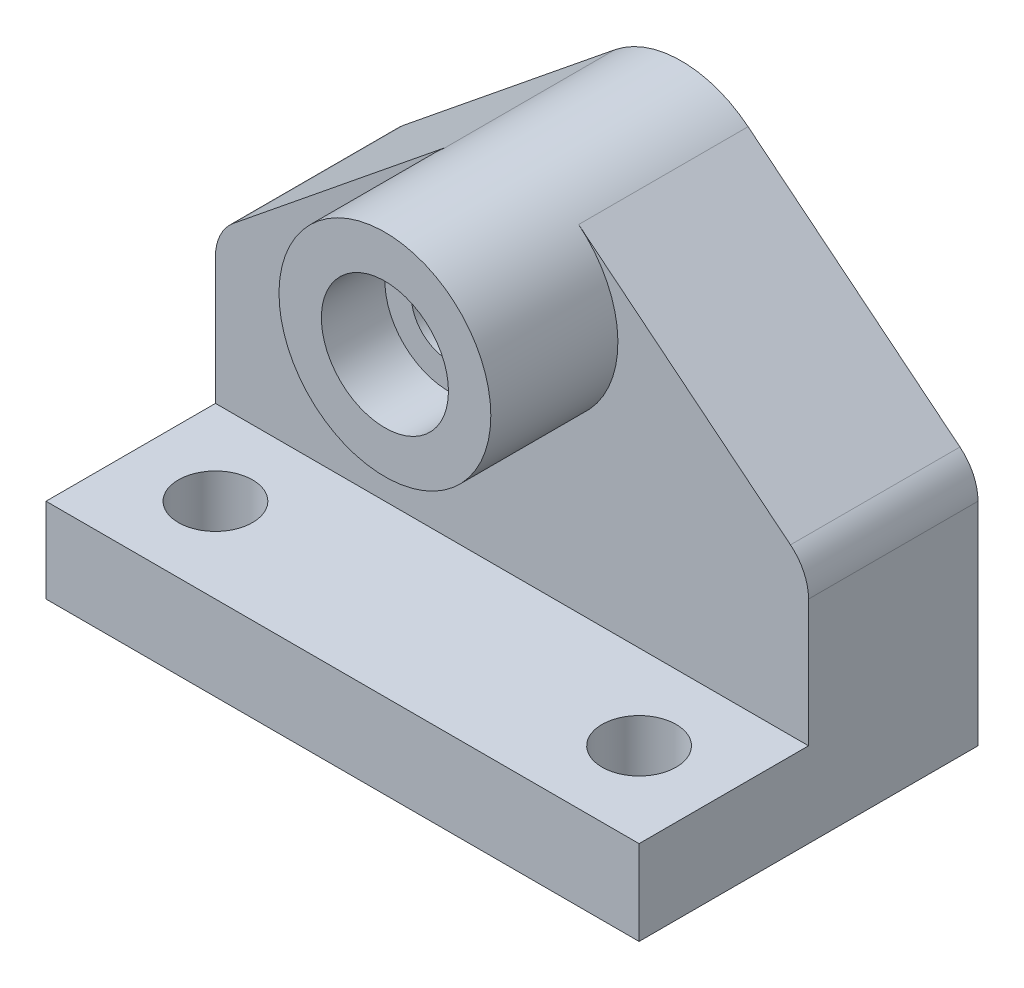
ISO-10303-21;
HEADER;
FILE_DESCRIPTION(('STEP AP214'),'2;1');
FILE_NAME('part.step','',(''),(''),'','','');
FILE_SCHEMA(('AUTOMOTIVE_DESIGN { 1 0 10303 214 1 1 1 1 }'));
ENDSEC;
DATA;
#1=APPLICATION_CONTEXT('core data for automotive mechanical design processes');
#2=APPLICATION_PROTOCOL_DEFINITION('international standard','automotive_design',2000,#1);
#3=PRODUCT_CONTEXT('',#1,'mechanical');
#4=PRODUCT('Part','Part','',(#3));
#5=PRODUCT_RELATED_PRODUCT_CATEGORY('part','',(#4));
#6=PRODUCT_DEFINITION_FORMATION('','',#4);
#7=PRODUCT_DEFINITION_CONTEXT('part definition',#1,'design');
#8=PRODUCT_DEFINITION('design','',#6,#7);
#9=PRODUCT_DEFINITION_SHAPE('','',#8);
#10=(LENGTH_UNIT() NAMED_UNIT(*) SI_UNIT(.MILLI.,.METRE.));
#11=(NAMED_UNIT(*) PLANE_ANGLE_UNIT() SI_UNIT($,.RADIAN.));
#12=(NAMED_UNIT(*) SI_UNIT($,.STERADIAN.) SOLID_ANGLE_UNIT());
#13=UNCERTAINTY_MEASURE_WITH_UNIT(LENGTH_MEASURE(1.E-05),#10,'distance_accuracy_value','');
#14=(GEOMETRIC_REPRESENTATION_CONTEXT(3) GLOBAL_UNCERTAINTY_ASSIGNED_CONTEXT((#13)) GLOBAL_UNIT_ASSIGNED_CONTEXT((#10,
#11,#12)) REPRESENTATION_CONTEXT('',''));
#15=CARTESIAN_POINT('',(0.,0.,0.));
#16=DIRECTION('',(0.,0.,1.));
#17=DIRECTION('',(1.,0.,0.));
#18=AXIS2_PLACEMENT_3D('',#15,#16,#17);
#19=CARTESIAN_POINT('',(70.,80.,40.));
#20=DIRECTION('',(0.,0.,-1.));
#21=DIRECTION('',(-1.,0.,0.));
#22=AXIS2_PLACEMENT_3D('',#19,#20,#21);
#23=PLANE('',#22);
#24=CARTESIAN_POINT('',(70.,80.,40.));
#25=DIRECTION('',(0.,0.,-1.));
#26=DIRECTION('',(-1.,0.,0.));
#27=AXIS2_PLACEMENT_3D('',#24,#25,#26);
#28=CIRCLE('',#27,25.);
#29=CARTESIAN_POINT('',(54.2688081868346,99.4301210530814,40.));
#30=VERTEX_POINT('',#29);
#31=CARTESIAN_POINT('',(85.7311918131654,99.4301210530814,40.));
#32=VERTEX_POINT('',#31);
#33=EDGE_CURVE('E11',#30,#32,#28,.F.);
#34=ORIENTED_EDGE('',*,*,#33,.F.);
#35=DIRECTION('',(0.777204842123257,0.629247672526616,0.));
#36=VECTOR('',#35,1.);
#37=CARTESIAN_POINT('',(-27.138854515152,33.5201067238951,40.));
#38=LINE('',#37,#36);
#39=CARTESIAN_POINT('',(4.26880818683461,58.9486650441633,40.));
#40=VERTEX_POINT('',#39);
#41=EDGE_CURVE('E100',#40,#30,#38,.T.);
#42=ORIENTED_EDGE('',*,*,#41,.F.);
#43=CARTESIAN_POINT('',(11.5139079933114,50.,40.));
#44=DIRECTION('',(0.,0.,1.));
#45=DIRECTION('',(1.,0.,0.));
#46=AXIS2_PLACEMENT_3D('',#43,#44,#45);
#47=CIRCLE('',#46,11.5139079933114);
#48=CARTESIAN_POINT('',(0.,50.,40.));
#49=VERTEX_POINT('',#48);
#50=EDGE_CURVE('E167',#49,#40,#47,.F.);
#51=ORIENTED_EDGE('',*,*,#50,.F.);
#52=DIRECTION('',(0.,-1.,0.));
#53=VECTOR('',#52,1.);
#54=CARTESIAN_POINT('',(0.,130.,40.));
#55=LINE('',#54,#53);
#56=CARTESIAN_POINT('',(0.,20.,40.));
#57=VERTEX_POINT('',#56);
#58=EDGE_CURVE('E158',#49,#57,#55,.T.);
#59=ORIENTED_EDGE('',*,*,#58,.T.);
#60=DIRECTION('',(-1.,0.,0.));
#61=VECTOR('',#60,1.);
#62=CARTESIAN_POINT('',(0.,20.,40.));
#63=LINE('',#62,#61);
#64=CARTESIAN_POINT('',(140.,20.,40.));
#65=VERTEX_POINT('',#64);
#66=EDGE_CURVE('E155',#65,#57,#63,.T.);
#67=ORIENTED_EDGE('',*,*,#66,.F.);
#68=DIRECTION('',(0.,-1.,0.));
#69=VECTOR('',#68,1.);
#70=CARTESIAN_POINT('',(140.,130.,40.));
#71=LINE('',#70,#69);
#72=CARTESIAN_POINT('',(140.,50.,40.));
#73=VERTEX_POINT('',#72);
#74=EDGE_CURVE('E161',#73,#65,#71,.T.);
#75=ORIENTED_EDGE('',*,*,#74,.F.);
#76=CARTESIAN_POINT('',(128.486092006689,50.,40.));
#77=DIRECTION('',(0.,0.,1.));
#78=DIRECTION('',(1.,0.,0.));
#79=AXIS2_PLACEMENT_3D('',#76,#77,#78);
#80=CIRCLE('',#79,11.5139079933114);
#81=CARTESIAN_POINT('',(135.731191813165,58.9486650441633,40.));
#82=VERTEX_POINT('',#81);
#83=EDGE_CURVE('E164',#73,#82,#80,.T.);
#84=ORIENTED_EDGE('',*,*,#83,.T.);
#85=DIRECTION('',(-0.777204842123257,0.629247672526616,0.));
#86=VECTOR('',#85,1.);
#87=CARTESIAN_POINT('',(82.5722231883748,101.987714041442,40.));
#88=LINE('',#87,#86);
#89=EDGE_CURVE('E182',#82,#32,#88,.T.);
#90=ORIENTED_EDGE('',*,*,#89,.T.);
#91=EDGE_LOOP('',(#34,#42,#51,#59,#67,#75,#84,#90));
#92=FACE_BOUND('',#91,.T.);
#93=ADVANCED_FACE('F37',(#92),#23,.F.);
#94=CARTESIAN_POINT('',(-27.138854515152,33.5201067238951,80.));
#95=DIRECTION('',(-0.629247672526616,0.777204842123257,0.));
#96=DIRECTION('',(-0.777204842123257,-0.629247672526616,0.));
#97=AXIS2_PLACEMENT_3D('',#94,#95,#96);
#98=PLANE('',#97);
#99=DIRECTION('',(0.,0.,-1.));
#100=VECTOR('',#99,1.);
#101=CARTESIAN_POINT('',(4.26880818683461,58.9486650441633,80.));
#102=LINE('',#101,#100);
#103=CARTESIAN_POINT('',(4.26880818683461,58.9486650441633,0.));
#104=VERTEX_POINT('',#103);
#105=EDGE_CURVE('E46',#40,#104,#102,.T.);
#106=ORIENTED_EDGE('',*,*,#105,.F.);
#107=ORIENTED_EDGE('',*,*,#41,.T.);
#108=DIRECTION('',(0.,0.,-1.));
#109=VECTOR('',#108,1.);
#110=CARTESIAN_POINT('',(54.2688081868346,99.4301210530814,40.));
#111=LINE('',#110,#109);
#112=CARTESIAN_POINT('',(54.2688081868346,99.4301210530814,0.));
#113=VERTEX_POINT('',#112);
#114=EDGE_CURVE('E108',#30,#113,#111,.T.);
#115=ORIENTED_EDGE('',*,*,#114,.T.);
#116=DIRECTION('',(0.777204842123257,0.629247672526616,0.));
#117=VECTOR('',#116,1.);
#118=CARTESIAN_POINT('',(-27.138854515152,33.5201067238951,0.));
#119=LINE('',#118,#117);
#120=EDGE_CURVE('E95',#104,#113,#119,.T.);
#121=ORIENTED_EDGE('',*,*,#120,.F.);
#122=EDGE_LOOP('',(#106,#107,#115,#121));
#123=FACE_BOUND('',#122,.T.);
#124=ADVANCED_FACE('F39',(#123),#98,.T.);
#125=CARTESIAN_POINT('',(11.5139079933114,50.,80.));
#126=DIRECTION('',(0.,0.,-1.));
#127=DIRECTION('',(-1.,0.,0.));
#128=AXIS2_PLACEMENT_3D('',#125,#126,#127);
#129=CYLINDRICAL_SURFACE('',#128,11.5139079933114);
#130=DIRECTION('',(0.,0.,-1.));
#131=VECTOR('',#130,1.);
#132=CARTESIAN_POINT('',(0.,50.,80.));
#133=LINE('',#132,#131);
#134=CARTESIAN_POINT('',(0.,50.,0.));
#135=VERTEX_POINT('',#134);
#136=EDGE_CURVE('E129',#49,#135,#133,.T.);
#137=ORIENTED_EDGE('',*,*,#136,.F.);
#138=ORIENTED_EDGE('',*,*,#50,.T.);
#139=ORIENTED_EDGE('',*,*,#105,.T.);
#140=CARTESIAN_POINT('',(11.5139079933114,50.,0.));
#141=DIRECTION('',(0.,0.,1.));
#142=DIRECTION('',(1.,0.,0.));
#143=AXIS2_PLACEMENT_3D('',#140,#141,#142);
#144=CIRCLE('',#143,11.5139079933114);
#145=EDGE_CURVE('E190',#135,#104,#144,.F.);
#146=ORIENTED_EDGE('',*,*,#145,.F.);
#147=EDGE_LOOP('',(#137,#138,#139,#146));
#148=FACE_BOUND('',#147,.T.);
#149=ADVANCED_FACE('F232',(#148),#129,.T.);
#150=CARTESIAN_POINT('',(0.,0.,80.));
#151=DIRECTION('',(-1.,0.,0.));
#152=DIRECTION('',(0.,0.,1.));
#153=AXIS2_PLACEMENT_3D('',#150,#151,#152);
#154=PLANE('',#153);
#155=DIRECTION('',(0.,0.,1.));
#156=VECTOR('',#155,1.);
#157=CARTESIAN_POINT('',(0.,20.,80.));
#158=LINE('',#157,#156);
#159=CARTESIAN_POINT('',(0.,20.,80.));
#160=VERTEX_POINT('',#159);
#161=EDGE_CURVE('E133',#57,#160,#158,.T.);
#162=ORIENTED_EDGE('',*,*,#161,.F.);
#163=ORIENTED_EDGE('',*,*,#58,.F.);
#164=ORIENTED_EDGE('',*,*,#136,.T.);
#165=DIRECTION('',(0.,1.,0.));
#166=VECTOR('',#165,1.);
#167=CARTESIAN_POINT('',(0.,0.,0.));
#168=LINE('',#167,#166);
#169=CARTESIAN_POINT('',(0.,0.,0.));
#170=VERTEX_POINT('',#169);
#171=EDGE_CURVE('E192',#170,#135,#168,.T.);
#172=ORIENTED_EDGE('',*,*,#171,.F.);
#173=DIRECTION('',(0.,0.,-1.));
#174=VECTOR('',#173,1.);
#175=CARTESIAN_POINT('',(0.,0.,80.));
#176=LINE('',#175,#174);
#177=CARTESIAN_POINT('',(0.,0.,80.));
#178=VERTEX_POINT('',#177);
#179=EDGE_CURVE('E127',#178,#170,#176,.T.);
#180=ORIENTED_EDGE('',*,*,#179,.F.);
#181=DIRECTION('',(0.,1.,0.));
#182=VECTOR('',#181,1.);
#183=CARTESIAN_POINT('',(0.,0.,80.));
#184=LINE('',#183,#182);
#185=EDGE_CURVE('E111',#178,#160,#184,.T.);
#186=ORIENTED_EDGE('',*,*,#185,.T.);
#187=EDGE_LOOP('',(#162,#163,#164,#172,#180,#186));
#188=FACE_BOUND('',#187,.T.);
#189=ADVANCED_FACE('F237',(#188),#154,.T.);
#190=CARTESIAN_POINT('',(140.,0.,80.));
#191=DIRECTION('',(-1.,0.,0.));
#192=DIRECTION('',(0.,0.,1.));
#193=AXIS2_PLACEMENT_3D('',#190,#191,#192);
#194=PLANE('',#193);
#195=ORIENTED_EDGE('',*,*,#74,.T.);
#196=DIRECTION('',(0.,0.,-1.));
#197=VECTOR('',#196,1.);
#198=CARTESIAN_POINT('',(140.,20.,80.));
#199=LINE('',#198,#197);
#200=CARTESIAN_POINT('',(140.,20.,80.));
#201=VERTEX_POINT('',#200);
#202=EDGE_CURVE('E152',#201,#65,#199,.T.);
#203=ORIENTED_EDGE('',*,*,#202,.F.);
#204=DIRECTION('',(0.,1.,0.));
#205=VECTOR('',#204,1.);
#206=CARTESIAN_POINT('',(140.,0.,80.));
#207=LINE('',#206,#205);
#208=CARTESIAN_POINT('',(140.,0.,80.));
#209=VERTEX_POINT('',#208);
#210=EDGE_CURVE('E122',#209,#201,#207,.T.);
#211=ORIENTED_EDGE('',*,*,#210,.F.);
#212=DIRECTION('',(0.,0.,-1.));
#213=VECTOR('',#212,1.);
#214=CARTESIAN_POINT('',(140.,0.,80.));
#215=LINE('',#214,#213);
#216=CARTESIAN_POINT('',(140.,0.,0.));
#217=VERTEX_POINT('',#216);
#218=EDGE_CURVE('E124',#209,#217,#215,.T.);
#219=ORIENTED_EDGE('',*,*,#218,.T.);
#220=DIRECTION('',(0.,1.,0.));
#221=VECTOR('',#220,1.);
#222=CARTESIAN_POINT('',(140.,0.,0.));
#223=LINE('',#222,#221);
#224=CARTESIAN_POINT('',(140.,50.,0.));
#225=VERTEX_POINT('',#224);
#226=EDGE_CURVE('E116',#217,#225,#223,.T.);
#227=ORIENTED_EDGE('',*,*,#226,.T.);
#228=DIRECTION('',(0.,0.,-1.));
#229=VECTOR('',#228,1.);
#230=CARTESIAN_POINT('',(140.,50.,80.));
#231=LINE('',#230,#229);
#232=EDGE_CURVE('E121',#73,#225,#231,.T.);
#233=ORIENTED_EDGE('',*,*,#232,.F.);
#234=EDGE_LOOP('',(#195,#203,#211,#219,#227,#233));
#235=FACE_BOUND('',#234,.T.);
#236=ADVANCED_FACE('F200',(#235),#194,.F.);
#237=CARTESIAN_POINT('',(128.486092006689,50.,80.));
#238=DIRECTION('',(0.,0.,-1.));
#239=DIRECTION('',(-1.,0.,0.));
#240=AXIS2_PLACEMENT_3D('',#237,#238,#239);
#241=CYLINDRICAL_SURFACE('',#240,11.5139079933114);
#242=ORIENTED_EDGE('',*,*,#83,.F.);
#243=ORIENTED_EDGE('',*,*,#232,.T.);
#244=CARTESIAN_POINT('',(128.486092006689,50.,0.));
#245=DIRECTION('',(0.,0.,1.));
#246=DIRECTION('',(1.,0.,0.));
#247=AXIS2_PLACEMENT_3D('',#244,#245,#246);
#248=CIRCLE('',#247,11.5139079933114);
#249=CARTESIAN_POINT('',(135.731191813165,58.9486650441633,0.));
#250=VERTEX_POINT('',#249);
#251=EDGE_CURVE('E112',#225,#250,#248,.T.);
#252=ORIENTED_EDGE('',*,*,#251,.T.);
#253=DIRECTION('',(0.,0.,-1.));
#254=VECTOR('',#253,1.);
#255=CARTESIAN_POINT('',(135.731191813165,58.9486650441633,80.));
#256=LINE('',#255,#254);
#257=EDGE_CURVE('E81',#82,#250,#256,.T.);
#258=ORIENTED_EDGE('',*,*,#257,.F.);
#259=EDGE_LOOP('',(#242,#243,#252,#258));
#260=FACE_BOUND('',#259,.T.);
#261=ADVANCED_FACE('F206',(#260),#241,.T.);
#262=CARTESIAN_POINT('',(82.5722231883748,101.987714041442,80.));
#263=DIRECTION('',(-0.629247672526616,-0.777204842123257,0.));
#264=DIRECTION('',(0.777204842123257,-0.629247672526616,0.));
#265=AXIS2_PLACEMENT_3D('',#262,#263,#264);
#266=PLANE('',#265);
#267=ORIENTED_EDGE('',*,*,#89,.F.);
#268=ORIENTED_EDGE('',*,*,#257,.T.);
#269=DIRECTION('',(-0.777204842123257,0.629247672526616,0.));
#270=VECTOR('',#269,1.);
#271=CARTESIAN_POINT('',(82.5722231883748,101.987714041442,0.));
#272=LINE('',#271,#270);
#273=CARTESIAN_POINT('',(85.7311918131654,99.4301210530814,0.));
#274=VERTEX_POINT('',#273);
#275=EDGE_CURVE('E92',#250,#274,#272,.T.);
#276=ORIENTED_EDGE('',*,*,#275,.T.);
#277=DIRECTION('',(0.,0.,-1.));
#278=VECTOR('',#277,1.);
#279=CARTESIAN_POINT('',(85.7311918131654,99.4301210530814,40.));
#280=LINE('',#279,#278);
#281=EDGE_CURVE('E99',#32,#274,#280,.T.);
#282=ORIENTED_EDGE('',*,*,#281,.F.);
#283=EDGE_LOOP('',(#267,#268,#276,#282));
#284=FACE_BOUND('',#283,.T.);
#285=ADVANCED_FACE('F110',(#284),#266,.F.);
#286=CARTESIAN_POINT('',(0.,0.,80.));
#287=DIRECTION('',(0.,0.,1.));
#288=DIRECTION('',(1.,0.,0.));
#289=AXIS2_PLACEMENT_3D('',#286,#287,#288);
#290=PLANE('',#289);
#291=DIRECTION('',(1.,0.,0.));
#292=VECTOR('',#291,1.);
#293=CARTESIAN_POINT('',(0.,20.,80.));
#294=LINE('',#293,#292);
#295=EDGE_CURVE('E138',#160,#201,#294,.T.);
#296=ORIENTED_EDGE('',*,*,#295,.F.);
#297=ORIENTED_EDGE('',*,*,#185,.F.);
#298=DIRECTION('',(1.,0.,0.));
#299=VECTOR('',#298,1.);
#300=CARTESIAN_POINT('',(0.,0.,80.));
#301=LINE('',#300,#299);
#302=EDGE_CURVE('E54',#178,#209,#301,.T.);
#303=ORIENTED_EDGE('',*,*,#302,.T.);
#304=ORIENTED_EDGE('',*,*,#210,.T.);
#305=EDGE_LOOP('',(#296,#297,#303,#304));
#306=FACE_BOUND('',#305,.T.);
#307=ADVANCED_FACE('F248',(#306),#290,.T.);
#308=CARTESIAN_POINT('',(0.,0.,80.));
#309=DIRECTION('',(0.,1.,0.));
#310=DIRECTION('',(0.,0.,1.));
#311=AXIS2_PLACEMENT_3D('',#308,#309,#310);
#312=PLANE('',#311);
#313=CARTESIAN_POINT('',(20.,0.,60.));
#314=DIRECTION('',(0.,1.,0.));
#315=DIRECTION('',(0.,0.,1.));
#316=AXIS2_PLACEMENT_3D('',#313,#314,#315);
#317=CIRCLE('',#316,8.74999999999999);
#318=CARTESIAN_POINT('',(20.,0.,68.75));
#319=VERTEX_POINT('',#318);
#320=EDGE_CURVE('E141',#319,#319,#317,.T.);
#321=ORIENTED_EDGE('',*,*,#320,.T.);
#322=EDGE_LOOP('',(#321));
#323=FACE_BOUND('',#322,.T.);
#324=CARTESIAN_POINT('',(120.,0.,60.));
#325=DIRECTION('',(0.,1.,0.));
#326=DIRECTION('',(0.,0.,1.));
#327=AXIS2_PLACEMENT_3D('',#324,#325,#326);
#328=CIRCLE('',#327,8.74999999999999);
#329=CARTESIAN_POINT('',(120.,0.,68.75));
#330=VERTEX_POINT('',#329);
#331=EDGE_CURVE('E131',#330,#330,#328,.T.);
#332=ORIENTED_EDGE('',*,*,#331,.T.);
#333=EDGE_LOOP('',(#332));
#334=FACE_BOUND('',#333,.T.);
#335=CARTESIAN_POINT('',(20.,0.,20.));
#336=DIRECTION('',(0.,-1.,0.));
#337=DIRECTION('',(0.,0.,-1.));
#338=AXIS2_PLACEMENT_3D('',#335,#336,#337);
#339=CIRCLE('',#338,8.74999999999999);
#340=CARTESIAN_POINT('',(20.,0.,11.25));
#341=VERTEX_POINT('',#340);
#342=EDGE_CURVE('E170',#341,#341,#339,.T.);
#343=ORIENTED_EDGE('',*,*,#342,.F.);
#344=EDGE_LOOP('',(#343));
#345=FACE_BOUND('',#344,.T.);
#346=CARTESIAN_POINT('',(120.,0.,20.));
#347=DIRECTION('',(0.,-1.,0.));
#348=DIRECTION('',(0.,0.,-1.));
#349=AXIS2_PLACEMENT_3D('',#346,#347,#348);
#350=CIRCLE('',#349,8.74999999999999);
#351=CARTESIAN_POINT('',(120.,0.,11.25));
#352=VERTEX_POINT('',#351);
#353=EDGE_CURVE('E176',#352,#352,#350,.T.);
#354=ORIENTED_EDGE('',*,*,#353,.F.);
#355=EDGE_LOOP('',(#354));
#356=FACE_BOUND('',#355,.T.);
#357=DIRECTION('',(1.,0.,0.));
#358=VECTOR('',#357,1.);
#359=CARTESIAN_POINT('',(0.,0.,0.));
#360=LINE('',#359,#358);
#361=EDGE_CURVE('E195',#170,#217,#360,.T.);
#362=ORIENTED_EDGE('',*,*,#361,.T.);
#363=ORIENTED_EDGE('',*,*,#218,.F.);
#364=ORIENTED_EDGE('',*,*,#302,.F.);
#365=ORIENTED_EDGE('',*,*,#179,.T.);
#366=EDGE_LOOP('',(#362,#363,#364,#365));
#367=FACE_BOUND('',#366,.T.);
#368=ADVANCED_FACE('F253',(#323,#334,#345,#356,#367),#312,.F.);
#369=CARTESIAN_POINT('',(0.,0.,0.));
#370=DIRECTION('',(0.,0.,1.));
#371=DIRECTION('',(1.,0.,0.));
#372=AXIS2_PLACEMENT_3D('',#369,#370,#371);
#373=PLANE('',#372);
#374=CARTESIAN_POINT('',(70.,80.,0.));
#375=DIRECTION('',(0.,0.,1.));
#376=DIRECTION('',(1.,0.,0.));
#377=AXIS2_PLACEMENT_3D('',#374,#375,#376);
#378=CIRCLE('',#377,8.74999999999998);
#379=CARTESIAN_POINT('',(78.75,80.,0.));
#380=VERTEX_POINT('',#379);
#381=EDGE_CURVE('E471',#380,#380,#378,.T.);
#382=ORIENTED_EDGE('',*,*,#381,.T.);
#383=EDGE_LOOP('',(#382));
#384=FACE_BOUND('',#383,.T.);
#385=ORIENTED_EDGE('',*,*,#120,.T.);
#386=CARTESIAN_POINT('',(70.,80.,0.));
#387=DIRECTION('',(0.,0.,-1.));
#388=DIRECTION('',(-1.,0.,0.));
#389=AXIS2_PLACEMENT_3D('',#386,#387,#388);
#390=CIRCLE('',#389,25.);
#391=EDGE_CURVE('E88',#113,#274,#390,.T.);
#392=ORIENTED_EDGE('',*,*,#391,.T.);
#393=ORIENTED_EDGE('',*,*,#275,.F.);
#394=ORIENTED_EDGE('',*,*,#251,.F.);
#395=ORIENTED_EDGE('',*,*,#226,.F.);
#396=ORIENTED_EDGE('',*,*,#361,.F.);
#397=ORIENTED_EDGE('',*,*,#171,.T.);
#398=ORIENTED_EDGE('',*,*,#145,.T.);
#399=EDGE_LOOP('',(#385,#392,#393,#394,#395,#396,#397,#398));
#400=FACE_BOUND('',#399,.T.);
#401=ADVANCED_FACE('F90',(#384,#400),#373,.F.);
#402=CARTESIAN_POINT('',(70.,80.,40.));
#403=DIRECTION('',(0.,0.,-1.));
#404=DIRECTION('',(-1.,0.,0.));
#405=AXIS2_PLACEMENT_3D('',#402,#403,#404);
#406=CYLINDRICAL_SURFACE('',#405,25.);
#407=ORIENTED_EDGE('',*,*,#114,.F.);
#408=ORIENTED_EDGE('',*,*,#33,.T.);
#409=ORIENTED_EDGE('',*,*,#281,.T.);
#410=ORIENTED_EDGE('',*,*,#391,.F.);
#411=EDGE_LOOP('',(#407,#408,#409,#410));
#412=FACE_BOUND('',#411,.T.);
#413=CARTESIAN_POINT('',(70.,80.,70.));
#414=DIRECTION('',(0.,0.,1.));
#415=DIRECTION('',(1.,0.,0.));
#416=AXIS2_PLACEMENT_3D('',#413,#414,#415);
#417=CIRCLE('',#416,25.);
#418=CARTESIAN_POINT('',(95.,80.,70.));
#419=VERTEX_POINT('',#418);
#420=EDGE_CURVE('E480',#419,#419,#417,.T.);
#421=ORIENTED_EDGE('',*,*,#420,.F.);
#422=EDGE_LOOP('',(#421));
#423=FACE_BOUND('',#422,.T.);
#424=ADVANCED_FACE('F103',(#412,#423),#406,.T.);
#425=CARTESIAN_POINT('',(120.,30.,20.));
#426=DIRECTION('',(0.,-1.,0.));
#427=DIRECTION('',(0.,0.,-1.));
#428=AXIS2_PLACEMENT_3D('',#425,#426,#427);
#429=CONICAL_SURFACE('',#428,8.74999999999999,1.02974425867665);
#430=CARTESIAN_POINT('',(120.,35.2575304164912,20.));
#431=VERTEX_POINT('',#430);
#432=VERTEX_LOOP('',#431);
#433=FACE_BOUND('',#432,.T.);
#434=CARTESIAN_POINT('',(120.,30.,20.));
#435=DIRECTION('',(0.,-1.,0.));
#436=DIRECTION('',(0.,0.,-1.));
#437=AXIS2_PLACEMENT_3D('',#434,#435,#436);
#438=CIRCLE('',#437,8.74999999999999);
#439=CARTESIAN_POINT('',(120.,30.,11.25));
#440=VERTEX_POINT('',#439);
#441=EDGE_CURVE('E179',#440,#440,#438,.T.);
#442=ORIENTED_EDGE('',*,*,#441,.T.);
#443=EDGE_LOOP('',(#442));
#444=FACE_BOUND('',#443,.T.);
#445=ADVANCED_FACE('F270',(#433,#444),#429,.F.);
#446=CARTESIAN_POINT('',(120.,0.,20.));
#447=DIRECTION('',(0.,-1.,0.));
#448=DIRECTION('',(0.,0.,-1.));
#449=AXIS2_PLACEMENT_3D('',#446,#447,#448);
#450=CYLINDRICAL_SURFACE('',#449,8.74999999999999);
#451=ORIENTED_EDGE('',*,*,#441,.F.);
#452=EDGE_LOOP('',(#451));
#453=FACE_BOUND('',#452,.T.);
#454=ORIENTED_EDGE('',*,*,#353,.T.);
#455=EDGE_LOOP('',(#454));
#456=FACE_BOUND('',#455,.T.);
#457=ADVANCED_FACE('F277',(#453,#456),#450,.F.);
#458=CARTESIAN_POINT('',(20.,30.,20.));
#459=DIRECTION('',(0.,-1.,0.));
#460=DIRECTION('',(0.,0.,-1.));
#461=AXIS2_PLACEMENT_3D('',#458,#459,#460);
#462=CONICAL_SURFACE('',#461,8.74999999999999,1.02974425867665);
#463=CARTESIAN_POINT('',(20.,35.2575304164912,20.));
#464=VERTEX_POINT('',#463);
#465=VERTEX_LOOP('',#464);
#466=FACE_BOUND('',#465,.T.);
#467=CARTESIAN_POINT('',(20.,30.,20.));
#468=DIRECTION('',(0.,-1.,0.));
#469=DIRECTION('',(0.,0.,-1.));
#470=AXIS2_PLACEMENT_3D('',#467,#468,#469);
#471=CIRCLE('',#470,8.74999999999999);
#472=CARTESIAN_POINT('',(20.,30.,11.25));
#473=VERTEX_POINT('',#472);
#474=EDGE_CURVE('E173',#473,#473,#471,.T.);
#475=ORIENTED_EDGE('',*,*,#474,.T.);
#476=EDGE_LOOP('',(#475));
#477=FACE_BOUND('',#476,.T.);
#478=ADVANCED_FACE('F427',(#466,#477),#462,.F.);
#479=CARTESIAN_POINT('',(20.,0.,20.));
#480=DIRECTION('',(0.,-1.,0.));
#481=DIRECTION('',(0.,0.,-1.));
#482=AXIS2_PLACEMENT_3D('',#479,#480,#481);
#483=CYLINDRICAL_SURFACE('',#482,8.74999999999999);
#484=ORIENTED_EDGE('',*,*,#474,.F.);
#485=EDGE_LOOP('',(#484));
#486=FACE_BOUND('',#485,.T.);
#487=ORIENTED_EDGE('',*,*,#342,.T.);
#488=EDGE_LOOP('',(#487));
#489=FACE_BOUND('',#488,.T.);
#490=ADVANCED_FACE('F335',(#486,#489),#483,.F.);
#491=CARTESIAN_POINT('',(0.,20.,0.));
#492=DIRECTION('',(0.,-1.,0.));
#493=DIRECTION('',(0.,0.,-1.));
#494=AXIS2_PLACEMENT_3D('',#491,#492,#493);
#495=PLANE('',#494);
#496=CARTESIAN_POINT('',(20.,20.,60.));
#497=DIRECTION('',(0.,1.,0.));
#498=DIRECTION('',(0.,0.,1.));
#499=AXIS2_PLACEMENT_3D('',#496,#497,#498);
#500=CIRCLE('',#499,8.74999999999999);
#501=CARTESIAN_POINT('',(20.,20.,68.75));
#502=VERTEX_POINT('',#501);
#503=EDGE_CURVE('E146',#502,#502,#500,.T.);
#504=ORIENTED_EDGE('',*,*,#503,.F.);
#505=EDGE_LOOP('',(#504));
#506=FACE_BOUND('',#505,.T.);
#507=CARTESIAN_POINT('',(120.,20.,60.));
#508=DIRECTION('',(0.,1.,0.));
#509=DIRECTION('',(0.,0.,1.));
#510=AXIS2_PLACEMENT_3D('',#507,#508,#509);
#511=CIRCLE('',#510,8.74999999999999);
#512=CARTESIAN_POINT('',(120.,20.,68.75));
#513=VERTEX_POINT('',#512);
#514=EDGE_CURVE('E134',#513,#513,#511,.T.);
#515=ORIENTED_EDGE('',*,*,#514,.F.);
#516=EDGE_LOOP('',(#515));
#517=FACE_BOUND('',#516,.T.);
#518=ORIENTED_EDGE('',*,*,#161,.T.);
#519=ORIENTED_EDGE('',*,*,#295,.T.);
#520=ORIENTED_EDGE('',*,*,#202,.T.);
#521=ORIENTED_EDGE('',*,*,#66,.T.);
#522=EDGE_LOOP('',(#518,#519,#520,#521));
#523=FACE_BOUND('',#522,.T.);
#524=ADVANCED_FACE('F244',(#506,#517,#523),#495,.F.);
#525=CARTESIAN_POINT('',(120.,20.,60.));
#526=DIRECTION('',(0.,1.,0.));
#527=DIRECTION('',(0.,0.,1.));
#528=AXIS2_PLACEMENT_3D('',#525,#526,#527);
#529=CYLINDRICAL_SURFACE('',#528,8.74999999999999);
#530=ORIENTED_EDGE('',*,*,#514,.T.);
#531=EDGE_LOOP('',(#530));
#532=FACE_BOUND('',#531,.T.);
#533=ORIENTED_EDGE('',*,*,#331,.F.);
#534=EDGE_LOOP('',(#533));
#535=FACE_BOUND('',#534,.T.);
#536=ADVANCED_FACE('F334',(#532,#535),#529,.F.);
#537=CARTESIAN_POINT('',(20.,20.,60.));
#538=DIRECTION('',(0.,1.,0.));
#539=DIRECTION('',(0.,0.,1.));
#540=AXIS2_PLACEMENT_3D('',#537,#538,#539);
#541=CYLINDRICAL_SURFACE('',#540,8.74999999999999);
#542=ORIENTED_EDGE('',*,*,#503,.T.);
#543=EDGE_LOOP('',(#542));
#544=FACE_BOUND('',#543,.T.);
#545=ORIENTED_EDGE('',*,*,#320,.F.);
#546=EDGE_LOOP('',(#545));
#547=FACE_BOUND('',#546,.T.);
#548=ADVANCED_FACE('F348',(#544,#547),#541,.F.);
#549=CARTESIAN_POINT('',(70.,80.,70.));
#550=DIRECTION('',(0.,0.,1.));
#551=DIRECTION('',(1.,0.,0.));
#552=AXIS2_PLACEMENT_3D('',#549,#550,#551);
#553=PLANE('',#552);
#554=CARTESIAN_POINT('',(70.,80.,70.));
#555=DIRECTION('',(0.,0.,1.));
#556=DIRECTION('',(1.,0.,0.));
#557=AXIS2_PLACEMENT_3D('',#554,#555,#556);
#558=CIRCLE('',#557,15.);
#559=CARTESIAN_POINT('',(85.,80.,70.));
#560=VERTEX_POINT('',#559);
#561=EDGE_CURVE('E472',#560,#560,#558,.T.);
#562=ORIENTED_EDGE('',*,*,#561,.F.);
#563=EDGE_LOOP('',(#562));
#564=FACE_BOUND('',#563,.T.);
#565=ORIENTED_EDGE('',*,*,#420,.T.);
#566=EDGE_LOOP('',(#565));
#567=FACE_BOUND('',#566,.T.);
#568=ADVANCED_FACE('F358',(#564,#567),#553,.T.);
#569=CARTESIAN_POINT('',(70.,80.,55.));
#570=DIRECTION('',(0.,0.,1.));
#571=DIRECTION('',(1.,0.,0.));
#572=AXIS2_PLACEMENT_3D('',#569,#570,#571);
#573=CYLINDRICAL_SURFACE('',#572,15.);
#574=CARTESIAN_POINT('',(70.,80.,55.));
#575=DIRECTION('',(0.,0.,1.));
#576=DIRECTION('',(1.,0.,0.));
#577=AXIS2_PLACEMENT_3D('',#574,#575,#576);
#578=CIRCLE('',#577,15.);
#579=CARTESIAN_POINT('',(85.,80.,55.));
#580=VERTEX_POINT('',#579);
#581=EDGE_CURVE('E475',#580,#580,#578,.T.);
#582=ORIENTED_EDGE('',*,*,#581,.F.);
#583=EDGE_LOOP('',(#582));
#584=FACE_BOUND('',#583,.T.);
#585=ORIENTED_EDGE('',*,*,#561,.T.);
#586=EDGE_LOOP('',(#585));
#587=FACE_BOUND('',#586,.T.);
#588=ADVANCED_FACE('F384',(#584,#587),#573,.F.);
#589=CARTESIAN_POINT('',(70.,80.,55.));
#590=DIRECTION('',(0.,0.,1.));
#591=DIRECTION('',(1.,0.,0.));
#592=AXIS2_PLACEMENT_3D('',#589,#590,#591);
#593=PLANE('',#592);
#594=CARTESIAN_POINT('',(70.,80.,55.));
#595=DIRECTION('',(0.,0.,1.));
#596=DIRECTION('',(1.,0.,0.));
#597=AXIS2_PLACEMENT_3D('',#594,#595,#596);
#598=CIRCLE('',#597,8.74999999999998);
#599=CARTESIAN_POINT('',(78.75,80.,55.));
#600=VERTEX_POINT('',#599);
#601=EDGE_CURVE('E469',#600,#600,#598,.T.);
#602=ORIENTED_EDGE('',*,*,#601,.F.);
#603=EDGE_LOOP('',(#602));
#604=FACE_BOUND('',#603,.T.);
#605=ORIENTED_EDGE('',*,*,#581,.T.);
#606=EDGE_LOOP('',(#605));
#607=FACE_BOUND('',#606,.T.);
#608=ADVANCED_FACE('F393',(#604,#607),#593,.T.);
#609=CARTESIAN_POINT('',(70.,80.,55.));
#610=DIRECTION('',(0.,0.,1.));
#611=DIRECTION('',(1.,0.,0.));
#612=AXIS2_PLACEMENT_3D('',#609,#610,#611);
#613=CYLINDRICAL_SURFACE('',#612,8.74999999999998);
#614=ORIENTED_EDGE('',*,*,#601,.T.);
#615=EDGE_LOOP('',(#614));
#616=FACE_BOUND('',#615,.T.);
#617=ORIENTED_EDGE('',*,*,#381,.F.);
#618=EDGE_LOOP('',(#617));
#619=FACE_BOUND('',#618,.T.);
#620=ADVANCED_FACE('F408',(#616,#619),#613,.F.);
#621=CLOSED_SHELL('',(#93,#124,#149,#189,#236,#261,#285,#307,#368,#401,#424,#445,#457,#478,#490,
#524,#536,#548,#568,#588,#608,#620));
#622=MANIFOLD_SOLID_BREP('B2',#621);
#623=ADVANCED_BREP_SHAPE_REPRESENTATION('',(#18,#622),#14);
#624=SHAPE_DEFINITION_REPRESENTATION(#9,#623);
ENDSEC;
END-ISO-10303-21;
